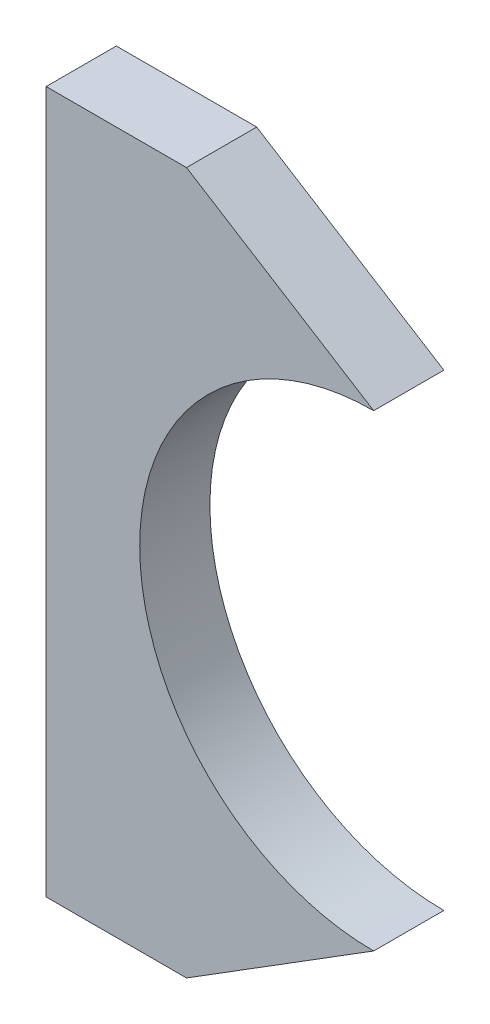
ISO-10303-21;
HEADER;
FILE_DESCRIPTION(('STEP AP214'),'2;1');
FILE_NAME('part.step','',(''),(''),'','','');
FILE_SCHEMA(('AUTOMOTIVE_DESIGN { 1 0 10303 214 1 1 1 1 }'));
ENDSEC;
DATA;
#1=APPLICATION_CONTEXT('core data for automotive mechanical design processes');
#2=APPLICATION_PROTOCOL_DEFINITION('international standard','automotive_design',2000,#1);
#3=PRODUCT_CONTEXT('',#1,'mechanical');
#4=PRODUCT('Part','Part','',(#3));
#5=PRODUCT_RELATED_PRODUCT_CATEGORY('part','',(#4));
#6=PRODUCT_DEFINITION_FORMATION('','',#4);
#7=PRODUCT_DEFINITION_CONTEXT('part definition',#1,'design');
#8=PRODUCT_DEFINITION('design','',#6,#7);
#9=PRODUCT_DEFINITION_SHAPE('','',#8);
#10=(LENGTH_UNIT() NAMED_UNIT(*) SI_UNIT(.MILLI.,.METRE.));
#11=(NAMED_UNIT(*) PLANE_ANGLE_UNIT() SI_UNIT($,.RADIAN.));
#12=(NAMED_UNIT(*) SI_UNIT($,.STERADIAN.) SOLID_ANGLE_UNIT());
#13=UNCERTAINTY_MEASURE_WITH_UNIT(LENGTH_MEASURE(1.E-05),#10,'distance_accuracy_value','');
#14=(GEOMETRIC_REPRESENTATION_CONTEXT(3) GLOBAL_UNCERTAINTY_ASSIGNED_CONTEXT((#13)) GLOBAL_UNIT_ASSIGNED_CONTEXT((#10,
#11,#12)) REPRESENTATION_CONTEXT('',''));
#15=CARTESIAN_POINT('',(0.,0.,0.));
#16=DIRECTION('',(0.,0.,1.));
#17=DIRECTION('',(1.,0.,0.));
#18=AXIS2_PLACEMENT_3D('',#15,#16,#17);
#19=CARTESIAN_POINT('',(0.,0.,7.5));
#20=DIRECTION('',(0.,0.,-1.));
#21=DIRECTION('',(-1.,0.,0.));
#22=AXIS2_PLACEMENT_3D('',#19,#20,#21);
#23=CYLINDRICAL_SURFACE('',#22,50.);
#24=CARTESIAN_POINT('',(0.,0.,-7.5));
#25=DIRECTION('',(0.,0.,-1.));
#26=DIRECTION('',(1.,0.,0.));
#27=AXIS2_PLACEMENT_3D('',#24,#25,#26);
#28=CIRCLE('',#27,50.);
#29=CARTESIAN_POINT('',(0.,-50.,-7.5));
#30=VERTEX_POINT('',#29);
#31=CARTESIAN_POINT('',(0.,50.,-7.5));
#32=VERTEX_POINT('',#31);
#33=EDGE_CURVE('E131',#30,#32,#28,.T.);
#34=ORIENTED_EDGE('',*,*,#33,.T.);
#35=DIRECTION('',(0.,0.,-1.));
#36=VECTOR('',#35,1.);
#37=CARTESIAN_POINT('',(0.,50.,7.5));
#38=LINE('',#37,#36);
#39=CARTESIAN_POINT('',(0.,50.,7.5));
#40=VERTEX_POINT('',#39);
#41=EDGE_CURVE('E11',#40,#32,#38,.T.);
#42=ORIENTED_EDGE('',*,*,#41,.F.);
#43=CARTESIAN_POINT('',(0.,0.,7.5));
#44=DIRECTION('',(0.,0.,-1.));
#45=DIRECTION('',(1.,0.,0.));
#46=AXIS2_PLACEMENT_3D('',#43,#44,#45);
#47=CIRCLE('',#46,50.);
#48=CARTESIAN_POINT('',(0.,-50.,7.5));
#49=VERTEX_POINT('',#48);
#50=EDGE_CURVE('E147',#49,#40,#47,.T.);
#51=ORIENTED_EDGE('',*,*,#50,.F.);
#52=DIRECTION('',(0.,0.,-1.));
#53=VECTOR('',#52,1.);
#54=CARTESIAN_POINT('',(0.,-50.,7.5));
#55=LINE('',#54,#53);
#56=EDGE_CURVE('E127',#49,#30,#55,.T.);
#57=ORIENTED_EDGE('',*,*,#56,.T.);
#58=EDGE_LOOP('',(#34,#42,#51,#57));
#59=FACE_BOUND('',#58,.T.);
#60=ADVANCED_FACE('F42',(#59),#23,.F.);
#61=CARTESIAN_POINT('',(-40.,75.,7.5));
#62=DIRECTION('',(-0.52999894000318,-0.847998304005088,0.));
#63=DIRECTION('',(0.847998304005088,-0.52999894000318,0.));
#64=AXIS2_PLACEMENT_3D('',#61,#62,#63);
#65=PLANE('',#64);
#66=DIRECTION('',(-0.847998304005088,0.52999894000318,0.));
#67=VECTOR('',#66,1.);
#68=CARTESIAN_POINT('',(-40.,75.,-7.5));
#69=LINE('',#68,#67);
#70=CARTESIAN_POINT('',(-40.,75.,-7.5));
#71=VERTEX_POINT('',#70);
#72=EDGE_CURVE('E135',#32,#71,#69,.T.);
#73=ORIENTED_EDGE('',*,*,#72,.T.);
#74=DIRECTION('',(0.,0.,-1.));
#75=VECTOR('',#74,1.);
#76=CARTESIAN_POINT('',(-40.,75.,7.5));
#77=LINE('',#76,#75);
#78=CARTESIAN_POINT('',(-40.,75.,7.5));
#79=VERTEX_POINT('',#78);
#80=EDGE_CURVE('E51',#79,#71,#77,.T.);
#81=ORIENTED_EDGE('',*,*,#80,.F.);
#82=DIRECTION('',(-0.847998304005088,0.52999894000318,0.));
#83=VECTOR('',#82,1.);
#84=CARTESIAN_POINT('',(-40.,75.,7.5));
#85=LINE('',#84,#83);
#86=EDGE_CURVE('E96',#40,#79,#85,.T.);
#87=ORIENTED_EDGE('',*,*,#86,.F.);
#88=ORIENTED_EDGE('',*,*,#41,.T.);
#89=EDGE_LOOP('',(#73,#81,#87,#88));
#90=FACE_BOUND('',#89,.T.);
#91=ADVANCED_FACE('F175',(#90),#65,.F.);
#92=CARTESIAN_POINT('',(-70.,75.,7.5));
#93=DIRECTION('',(0.,-1.,0.));
#94=DIRECTION('',(0.,0.,-1.));
#95=AXIS2_PLACEMENT_3D('',#92,#93,#94);
#96=PLANE('',#95);
#97=DIRECTION('',(-1.,0.,0.));
#98=VECTOR('',#97,1.);
#99=CARTESIAN_POINT('',(-70.,75.,-7.5));
#100=LINE('',#99,#98);
#101=CARTESIAN_POINT('',(-70.,75.,-7.5));
#102=VERTEX_POINT('',#101);
#103=EDGE_CURVE('E138',#71,#102,#100,.T.);
#104=ORIENTED_EDGE('',*,*,#103,.T.);
#105=DIRECTION('',(0.,0.,-1.));
#106=VECTOR('',#105,1.);
#107=CARTESIAN_POINT('',(-70.,75.,7.5));
#108=LINE('',#107,#106);
#109=CARTESIAN_POINT('',(-70.,75.,7.5));
#110=VERTEX_POINT('',#109);
#111=EDGE_CURVE('E120',#110,#102,#108,.T.);
#112=ORIENTED_EDGE('',*,*,#111,.F.);
#113=DIRECTION('',(-1.,0.,0.));
#114=VECTOR('',#113,1.);
#115=CARTESIAN_POINT('',(-70.,75.,7.5));
#116=LINE('',#115,#114);
#117=EDGE_CURVE('E109',#79,#110,#116,.T.);
#118=ORIENTED_EDGE('',*,*,#117,.F.);
#119=ORIENTED_EDGE('',*,*,#80,.T.);
#120=EDGE_LOOP('',(#104,#112,#118,#119));
#121=FACE_BOUND('',#120,.T.);
#122=ADVANCED_FACE('F157',(#121),#96,.F.);
#123=CARTESIAN_POINT('',(-70.,75.,7.5));
#124=DIRECTION('',(1.,0.,0.));
#125=DIRECTION('',(0.,1.,0.));
#126=AXIS2_PLACEMENT_3D('',#123,#124,#125);
#127=PLANE('',#126);
#128=DIRECTION('',(0.,-1.,0.));
#129=VECTOR('',#128,1.);
#130=CARTESIAN_POINT('',(-70.,75.,-7.5));
#131=LINE('',#130,#129);
#132=CARTESIAN_POINT('',(-70.,-75.,-7.5));
#133=VERTEX_POINT('',#132);
#134=EDGE_CURVE('E118',#102,#133,#131,.T.);
#135=ORIENTED_EDGE('',*,*,#134,.T.);
#136=DIRECTION('',(0.,0.,-1.));
#137=VECTOR('',#136,1.);
#138=CARTESIAN_POINT('',(-70.,-75.,7.5));
#139=LINE('',#138,#137);
#140=CARTESIAN_POINT('',(-70.,-75.,7.5));
#141=VERTEX_POINT('',#140);
#142=EDGE_CURVE('E115',#141,#133,#139,.T.);
#143=ORIENTED_EDGE('',*,*,#142,.F.);
#144=DIRECTION('',(0.,-1.,0.));
#145=VECTOR('',#144,1.);
#146=CARTESIAN_POINT('',(-70.,75.,7.5));
#147=LINE('',#146,#145);
#148=EDGE_CURVE('E103',#110,#141,#147,.T.);
#149=ORIENTED_EDGE('',*,*,#148,.F.);
#150=ORIENTED_EDGE('',*,*,#111,.T.);
#151=EDGE_LOOP('',(#135,#143,#149,#150));
#152=FACE_BOUND('',#151,.T.);
#153=ADVANCED_FACE('F116',(#152),#127,.F.);
#154=CARTESIAN_POINT('',(-70.,-75.,7.5));
#155=DIRECTION('',(0.,1.,0.));
#156=DIRECTION('',(0.,0.,1.));
#157=AXIS2_PLACEMENT_3D('',#154,#155,#156);
#158=PLANE('',#157);
#159=DIRECTION('',(1.,0.,0.));
#160=VECTOR('',#159,1.);
#161=CARTESIAN_POINT('',(-70.,-75.,-7.5));
#162=LINE('',#161,#160);
#163=CARTESIAN_POINT('',(-40.,-75.,-7.5));
#164=VERTEX_POINT('',#163);
#165=EDGE_CURVE('E82',#133,#164,#162,.T.);
#166=ORIENTED_EDGE('',*,*,#165,.T.);
#167=DIRECTION('',(0.,0.,-1.));
#168=VECTOR('',#167,1.);
#169=CARTESIAN_POINT('',(-40.,-75.,7.5));
#170=LINE('',#169,#168);
#171=CARTESIAN_POINT('',(-40.,-75.,7.5));
#172=VERTEX_POINT('',#171);
#173=EDGE_CURVE('E121',#172,#164,#170,.T.);
#174=ORIENTED_EDGE('',*,*,#173,.F.);
#175=DIRECTION('',(1.,0.,0.));
#176=VECTOR('',#175,1.);
#177=CARTESIAN_POINT('',(-70.,-75.,7.5));
#178=LINE('',#177,#176);
#179=EDGE_CURVE('E107',#141,#172,#178,.T.);
#180=ORIENTED_EDGE('',*,*,#179,.F.);
#181=ORIENTED_EDGE('',*,*,#142,.T.);
#182=EDGE_LOOP('',(#166,#174,#180,#181));
#183=FACE_BOUND('',#182,.T.);
#184=ADVANCED_FACE('F123',(#183),#158,.F.);
#185=CARTESIAN_POINT('',(-40.,-75.,7.5));
#186=DIRECTION('',(-0.52999894000318,0.847998304005088,0.));
#187=DIRECTION('',(-0.847998304005088,-0.52999894000318,0.));
#188=AXIS2_PLACEMENT_3D('',#185,#186,#187);
#189=PLANE('',#188);
#190=DIRECTION('',(0.847998304005088,0.52999894000318,0.));
#191=VECTOR('',#190,1.);
#192=CARTESIAN_POINT('',(-40.,-75.,-7.5));
#193=LINE('',#192,#191);
#194=EDGE_CURVE('E88',#164,#30,#193,.T.);
#195=ORIENTED_EDGE('',*,*,#194,.T.);
#196=ORIENTED_EDGE('',*,*,#56,.F.);
#197=DIRECTION('',(0.847998304005088,0.52999894000318,0.));
#198=VECTOR('',#197,1.);
#199=CARTESIAN_POINT('',(-40.,-75.,7.5));
#200=LINE('',#199,#198);
#201=EDGE_CURVE('E59',#172,#49,#200,.T.);
#202=ORIENTED_EDGE('',*,*,#201,.F.);
#203=ORIENTED_EDGE('',*,*,#173,.T.);
#204=EDGE_LOOP('',(#195,#196,#202,#203));
#205=FACE_BOUND('',#204,.T.);
#206=ADVANCED_FACE('F164',(#205),#189,.F.);
#207=CARTESIAN_POINT('',(0.,0.,7.5));
#208=DIRECTION('',(0.,0.,1.));
#209=DIRECTION('',(1.,0.,0.));
#210=AXIS2_PLACEMENT_3D('',#207,#208,#209);
#211=PLANE('',#210);
#212=ORIENTED_EDGE('',*,*,#50,.T.);
#213=ORIENTED_EDGE('',*,*,#86,.T.);
#214=ORIENTED_EDGE('',*,*,#117,.T.);
#215=ORIENTED_EDGE('',*,*,#148,.T.);
#216=ORIENTED_EDGE('',*,*,#179,.T.);
#217=ORIENTED_EDGE('',*,*,#201,.T.);
#218=EDGE_LOOP('',(#212,#213,#214,#215,#216,#217));
#219=FACE_BOUND('',#218,.T.);
#220=ADVANCED_FACE('F105',(#219),#211,.T.);
#221=CARTESIAN_POINT('',(0.,0.,-7.5));
#222=DIRECTION('',(0.,0.,1.));
#223=DIRECTION('',(1.,0.,0.));
#224=AXIS2_PLACEMENT_3D('',#221,#222,#223);
#225=PLANE('',#224);
#226=ORIENTED_EDGE('',*,*,#33,.F.);
#227=ORIENTED_EDGE('',*,*,#194,.F.);
#228=ORIENTED_EDGE('',*,*,#165,.F.);
#229=ORIENTED_EDGE('',*,*,#134,.F.);
#230=ORIENTED_EDGE('',*,*,#103,.F.);
#231=ORIENTED_EDGE('',*,*,#72,.F.);
#232=EDGE_LOOP('',(#226,#227,#228,#229,#230,#231));
#233=FACE_BOUND('',#232,.T.);
#234=ADVANCED_FACE('F160',(#233),#225,.F.);
#235=CLOSED_SHELL('',(#60,#91,#122,#153,#184,#206,#220,#234));
#236=MANIFOLD_SOLID_BREP('B2',#235);
#237=ADVANCED_BREP_SHAPE_REPRESENTATION('',(#18,#236),#14);
#238=SHAPE_DEFINITION_REPRESENTATION(#9,#237);
ENDSEC;
END-ISO-10303-21;
